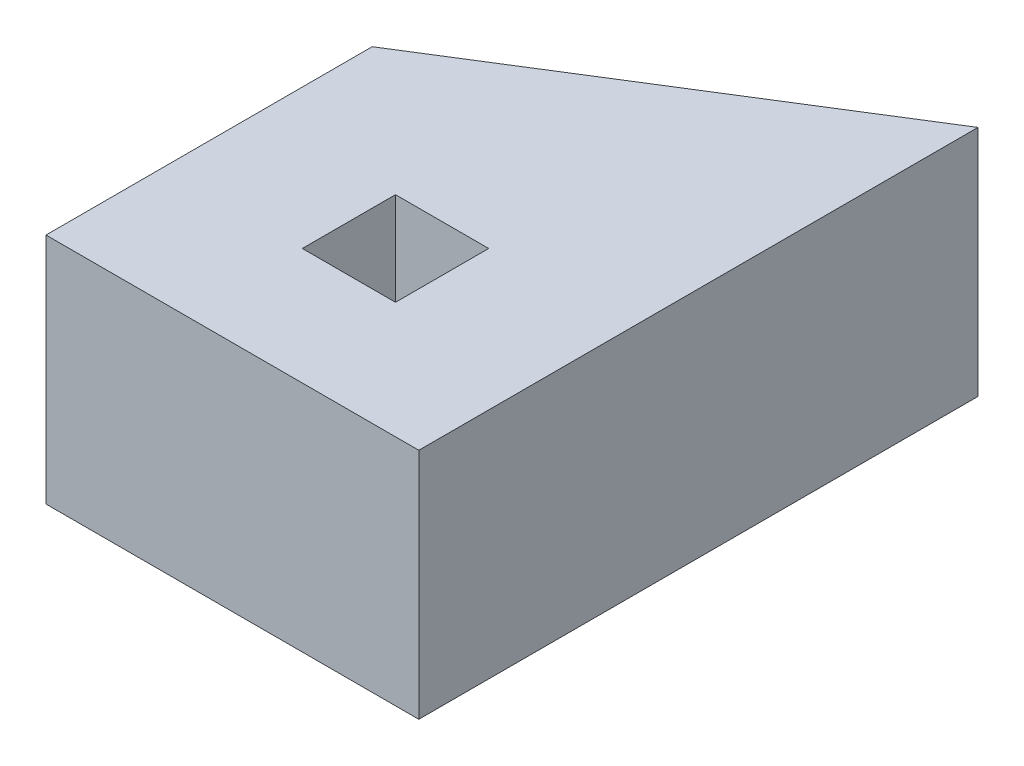
ISO-10303-21;
HEADER;
FILE_DESCRIPTION(('STEP AP214'),'2;1');
FILE_NAME('part.step','',(''),(''),'','','');
FILE_SCHEMA(('AUTOMOTIVE_DESIGN { 1 0 10303 214 1 1 1 1 }'));
ENDSEC;
DATA;
#1=APPLICATION_CONTEXT('core data for automotive mechanical design processes');
#2=APPLICATION_PROTOCOL_DEFINITION('international standard','automotive_design',2000,#1);
#3=PRODUCT_CONTEXT('',#1,'mechanical');
#4=PRODUCT('Part','Part','',(#3));
#5=PRODUCT_RELATED_PRODUCT_CATEGORY('part','',(#4));
#6=PRODUCT_DEFINITION_FORMATION('','',#4);
#7=PRODUCT_DEFINITION_CONTEXT('part definition',#1,'design');
#8=PRODUCT_DEFINITION('design','',#6,#7);
#9=PRODUCT_DEFINITION_SHAPE('','',#8);
#10=(LENGTH_UNIT() NAMED_UNIT(*) SI_UNIT(.MILLI.,.METRE.));
#11=(NAMED_UNIT(*) PLANE_ANGLE_UNIT() SI_UNIT($,.RADIAN.));
#12=(NAMED_UNIT(*) SI_UNIT($,.STERADIAN.) SOLID_ANGLE_UNIT());
#13=UNCERTAINTY_MEASURE_WITH_UNIT(LENGTH_MEASURE(1.E-05),#10,'distance_accuracy_value','');
#14=(GEOMETRIC_REPRESENTATION_CONTEXT(3) GLOBAL_UNCERTAINTY_ASSIGNED_CONTEXT((#13)) GLOBAL_UNIT_ASSIGNED_CONTEXT((#10,
#11,#12)) REPRESENTATION_CONTEXT('',''));
#15=CARTESIAN_POINT('',(0.,0.,0.));
#16=DIRECTION('',(0.,0.,1.));
#17=DIRECTION('',(1.,0.,0.));
#18=AXIS2_PLACEMENT_3D('',#15,#16,#17);
#19=CARTESIAN_POINT('',(0.,50.,35.));
#20=DIRECTION('',(0.,0.,-1.));
#21=DIRECTION('',(-1.,0.,0.));
#22=AXIS2_PLACEMENT_3D('',#19,#20,#21);
#23=PLANE('',#22);
#24=DIRECTION('',(1.,0.,0.));
#25=VECTOR('',#24,1.);
#26=CARTESIAN_POINT('',(0.,0.,35.));
#27=LINE('',#26,#25);
#28=CARTESIAN_POINT('',(-40.,0.,35.));
#29=VERTEX_POINT('',#28);
#30=CARTESIAN_POINT('',(40.,0.,35.));
#31=VERTEX_POINT('',#30);
#32=EDGE_CURVE('E131',#29,#31,#27,.T.);
#33=ORIENTED_EDGE('',*,*,#32,.T.);
#34=DIRECTION('',(0.,-1.,0.));
#35=VECTOR('',#34,1.);
#36=CARTESIAN_POINT('',(40.,50.,35.));
#37=LINE('',#36,#35);
#38=CARTESIAN_POINT('',(40.,50.,35.));
#39=VERTEX_POINT('',#38);
#40=EDGE_CURVE('E11',#39,#31,#37,.T.);
#41=ORIENTED_EDGE('',*,*,#40,.F.);
#42=DIRECTION('',(1.,0.,0.));
#43=VECTOR('',#42,1.);
#44=CARTESIAN_POINT('',(0.,50.,35.));
#45=LINE('',#44,#43);
#46=CARTESIAN_POINT('',(-40.,50.,35.));
#47=VERTEX_POINT('',#46);
#48=EDGE_CURVE('E135',#47,#39,#45,.T.);
#49=ORIENTED_EDGE('',*,*,#48,.F.);
#50=DIRECTION('',(0.,-1.,0.));
#51=VECTOR('',#50,1.);
#52=CARTESIAN_POINT('',(-40.,50.,35.));
#53=LINE('',#52,#51);
#54=EDGE_CURVE('E146',#47,#29,#53,.T.);
#55=ORIENTED_EDGE('',*,*,#54,.T.);
#56=EDGE_LOOP('',(#33,#41,#49,#55));
#57=FACE_BOUND('',#56,.T.);
#58=ADVANCED_FACE('F34',(#57),#23,.F.);
#59=CARTESIAN_POINT('',(40.,50.,0.));
#60=DIRECTION('',(-1.,0.,0.));
#61=DIRECTION('',(0.,0.,1.));
#62=AXIS2_PLACEMENT_3D('',#59,#60,#61);
#63=PLANE('',#62);
#64=DIRECTION('',(0.,0.,-1.));
#65=VECTOR('',#64,1.);
#66=CARTESIAN_POINT('',(40.,0.,0.));
#67=LINE('',#66,#65);
#68=CARTESIAN_POINT('',(40.,0.,-85.));
#69=VERTEX_POINT('',#68);
#70=EDGE_CURVE('E149',#31,#69,#67,.T.);
#71=ORIENTED_EDGE('',*,*,#70,.T.);
#72=DIRECTION('',(0.,-1.,0.));
#73=VECTOR('',#72,1.);
#74=CARTESIAN_POINT('',(40.,50.,-85.));
#75=LINE('',#74,#73);
#76=CARTESIAN_POINT('',(40.,50.,-85.));
#77=VERTEX_POINT('',#76);
#78=EDGE_CURVE('E41',#77,#69,#75,.T.);
#79=ORIENTED_EDGE('',*,*,#78,.F.);
#80=DIRECTION('',(0.,0.,-1.));
#81=VECTOR('',#80,1.);
#82=CARTESIAN_POINT('',(40.,50.,0.));
#83=LINE('',#82,#81);
#84=EDGE_CURVE('E138',#39,#77,#83,.T.);
#85=ORIENTED_EDGE('',*,*,#84,.F.);
#86=ORIENTED_EDGE('',*,*,#40,.T.);
#87=EDGE_LOOP('',(#71,#79,#85,#86));
#88=FACE_BOUND('',#87,.T.);
#89=ADVANCED_FACE('F175',(#88),#63,.F.);
#90=CARTESIAN_POINT('',(-26.9662921348315,50.,-43.1460674157303));
#91=DIRECTION('',(0.52999894000318,0.,0.847998304005088));
#92=DIRECTION('',(0.847998304005088,0.,-0.52999894000318));
#93=AXIS2_PLACEMENT_3D('',#90,#91,#92);
#94=PLANE('',#93);
#95=DIRECTION('',(-0.847998304005088,0.,0.52999894000318));
#96=VECTOR('',#95,1.);
#97=CARTESIAN_POINT('',(-26.9662921348315,0.,-43.1460674157303));
#98=LINE('',#97,#96);
#99=CARTESIAN_POINT('',(-40.,0.,-35.));
#100=VERTEX_POINT('',#99);
#101=EDGE_CURVE('E151',#69,#100,#98,.T.);
#102=ORIENTED_EDGE('',*,*,#101,.T.);
#103=DIRECTION('',(0.,-1.,0.));
#104=VECTOR('',#103,1.);
#105=CARTESIAN_POINT('',(-40.,50.,-35.));
#106=LINE('',#105,#104);
#107=CARTESIAN_POINT('',(-40.,50.,-35.));
#108=VERTEX_POINT('',#107);
#109=EDGE_CURVE('E157',#108,#100,#106,.T.);
#110=ORIENTED_EDGE('',*,*,#109,.F.);
#111=DIRECTION('',(-0.847998304005088,0.,0.52999894000318));
#112=VECTOR('',#111,1.);
#113=CARTESIAN_POINT('',(-26.9662921348315,50.,-43.1460674157303));
#114=LINE('',#113,#112);
#115=EDGE_CURVE('E141',#77,#108,#114,.T.);
#116=ORIENTED_EDGE('',*,*,#115,.F.);
#117=ORIENTED_EDGE('',*,*,#78,.T.);
#118=EDGE_LOOP('',(#102,#110,#116,#117));
#119=FACE_BOUND('',#118,.T.);
#120=ADVANCED_FACE('F163',(#119),#94,.F.);
#121=CARTESIAN_POINT('',(-40.,50.,0.));
#122=DIRECTION('',(-1.,0.,0.));
#123=DIRECTION('',(0.,0.,1.));
#124=AXIS2_PLACEMENT_3D('',#121,#122,#123);
#125=PLANE('',#124);
#126=DIRECTION('',(0.,0.,-1.));
#127=VECTOR('',#126,1.);
#128=CARTESIAN_POINT('',(-40.,0.,0.));
#129=LINE('',#128,#127);
#130=EDGE_CURVE('E139',#29,#100,#129,.T.);
#131=ORIENTED_EDGE('',*,*,#130,.F.);
#132=ORIENTED_EDGE('',*,*,#54,.F.);
#133=DIRECTION('',(0.,0.,-1.));
#134=VECTOR('',#133,1.);
#135=CARTESIAN_POINT('',(-40.,50.,0.));
#136=LINE('',#135,#134);
#137=EDGE_CURVE('E143',#47,#108,#136,.T.);
#138=ORIENTED_EDGE('',*,*,#137,.T.);
#139=ORIENTED_EDGE('',*,*,#109,.T.);
#140=EDGE_LOOP('',(#131,#132,#138,#139));
#141=FACE_BOUND('',#140,.T.);
#142=ADVANCED_FACE('F169',(#141),#125,.T.);
#143=CARTESIAN_POINT('',(0.,50.,0.));
#144=DIRECTION('',(0.,1.,0.));
#145=DIRECTION('',(0.,0.,1.));
#146=AXIS2_PLACEMENT_3D('',#143,#144,#145);
#147=PLANE('',#146);
#148=DIRECTION('',(0.,0.,-1.));
#149=VECTOR('',#148,1.);
#150=CARTESIAN_POINT('',(10.,50.,10.));
#151=LINE('',#150,#149);
#152=CARTESIAN_POINT('',(10.,50.,10.));
#153=VERTEX_POINT('',#152);
#154=CARTESIAN_POINT('',(10.,50.,-10.));
#155=VERTEX_POINT('',#154);
#156=EDGE_CURVE('E48',#153,#155,#151,.T.);
#157=ORIENTED_EDGE('',*,*,#156,.F.);
#158=DIRECTION('',(1.,0.,0.));
#159=VECTOR('',#158,1.);
#160=CARTESIAN_POINT('',(-10.,50.,10.));
#161=LINE('',#160,#159);
#162=CARTESIAN_POINT('',(-10.,50.,10.));
#163=VERTEX_POINT('',#162);
#164=EDGE_CURVE('E116',#163,#153,#161,.T.);
#165=ORIENTED_EDGE('',*,*,#164,.F.);
#166=DIRECTION('',(0.,0.,1.));
#167=VECTOR('',#166,1.);
#168=CARTESIAN_POINT('',(-10.,50.,10.));
#169=LINE('',#168,#167);
#170=CARTESIAN_POINT('',(-10.,50.,-10.));
#171=VERTEX_POINT('',#170);
#172=EDGE_CURVE('E119',#171,#163,#169,.T.);
#173=ORIENTED_EDGE('',*,*,#172,.F.);
#174=DIRECTION('',(-1.,0.,0.));
#175=VECTOR('',#174,1.);
#176=CARTESIAN_POINT('',(-10.,50.,-10.));
#177=LINE('',#176,#175);
#178=EDGE_CURVE('E125',#155,#171,#177,.T.);
#179=ORIENTED_EDGE('',*,*,#178,.F.);
#180=EDGE_LOOP('',(#157,#165,#173,#179));
#181=FACE_BOUND('',#180,.T.);
#182=ORIENTED_EDGE('',*,*,#48,.T.);
#183=ORIENTED_EDGE('',*,*,#84,.T.);
#184=ORIENTED_EDGE('',*,*,#115,.T.);
#185=ORIENTED_EDGE('',*,*,#137,.F.);
#186=EDGE_LOOP('',(#182,#183,#184,#185));
#187=FACE_BOUND('',#186,.T.);
#188=ADVANCED_FACE('F173',(#181,#187),#147,.T.);
#189=CARTESIAN_POINT('',(0.,0.,0.));
#190=DIRECTION('',(0.,1.,0.));
#191=DIRECTION('',(0.,0.,1.));
#192=AXIS2_PLACEMENT_3D('',#189,#190,#191);
#193=PLANE('',#192);
#194=DIRECTION('',(1.,0.,0.));
#195=VECTOR('',#194,1.);
#196=CARTESIAN_POINT('',(-10.,0.,10.));
#197=LINE('',#196,#195);
#198=CARTESIAN_POINT('',(-10.,0.,10.));
#199=VERTEX_POINT('',#198);
#200=CARTESIAN_POINT('',(10.,0.,10.));
#201=VERTEX_POINT('',#200);
#202=EDGE_CURVE('E106',#199,#201,#197,.T.);
#203=ORIENTED_EDGE('',*,*,#202,.T.);
#204=DIRECTION('',(0.,0.,-1.));
#205=VECTOR('',#204,1.);
#206=CARTESIAN_POINT('',(10.,0.,10.));
#207=LINE('',#206,#205);
#208=CARTESIAN_POINT('',(10.,0.,-10.));
#209=VERTEX_POINT('',#208);
#210=EDGE_CURVE('E100',#201,#209,#207,.T.);
#211=ORIENTED_EDGE('',*,*,#210,.T.);
#212=DIRECTION('',(-1.,0.,0.));
#213=VECTOR('',#212,1.);
#214=CARTESIAN_POINT('',(-10.,0.,-10.));
#215=LINE('',#214,#213);
#216=CARTESIAN_POINT('',(-10.,0.,-10.));
#217=VERTEX_POINT('',#216);
#218=EDGE_CURVE('E109',#209,#217,#215,.T.);
#219=ORIENTED_EDGE('',*,*,#218,.T.);
#220=DIRECTION('',(0.,0.,1.));
#221=VECTOR('',#220,1.);
#222=CARTESIAN_POINT('',(-10.,0.,10.));
#223=LINE('',#222,#221);
#224=EDGE_CURVE('E56',#217,#199,#223,.T.);
#225=ORIENTED_EDGE('',*,*,#224,.T.);
#226=EDGE_LOOP('',(#203,#211,#219,#225));
#227=FACE_BOUND('',#226,.T.);
#228=ORIENTED_EDGE('',*,*,#32,.F.);
#229=ORIENTED_EDGE('',*,*,#130,.T.);
#230=ORIENTED_EDGE('',*,*,#101,.F.);
#231=ORIENTED_EDGE('',*,*,#70,.F.);
#232=EDGE_LOOP('',(#228,#229,#230,#231));
#233=FACE_BOUND('',#232,.T.);
#234=ADVANCED_FACE('F113',(#227,#233),#193,.F.);
#235=CARTESIAN_POINT('',(10.,0.,10.));
#236=DIRECTION('',(1.,0.,0.));
#237=DIRECTION('',(0.,0.,-1.));
#238=AXIS2_PLACEMENT_3D('',#235,#236,#237);
#239=PLANE('',#238);
#240=ORIENTED_EDGE('',*,*,#156,.T.);
#241=DIRECTION('',(0.,1.,0.));
#242=VECTOR('',#241,1.);
#243=CARTESIAN_POINT('',(10.,0.,-10.));
#244=LINE('',#243,#242);
#245=EDGE_CURVE('E96',#209,#155,#244,.T.);
#246=ORIENTED_EDGE('',*,*,#245,.F.);
#247=ORIENTED_EDGE('',*,*,#210,.F.);
#248=DIRECTION('',(0.,1.,0.));
#249=VECTOR('',#248,1.);
#250=CARTESIAN_POINT('',(10.,0.,10.));
#251=LINE('',#250,#249);
#252=EDGE_CURVE('E129',#201,#153,#251,.T.);
#253=ORIENTED_EDGE('',*,*,#252,.T.);
#254=EDGE_LOOP('',(#240,#246,#247,#253));
#255=FACE_BOUND('',#254,.T.);
#256=ADVANCED_FACE('F98',(#255),#239,.F.);
#257=CARTESIAN_POINT('',(-10.,0.,10.));
#258=DIRECTION('',(0.,0.,1.));
#259=DIRECTION('',(1.,0.,0.));
#260=AXIS2_PLACEMENT_3D('',#257,#258,#259);
#261=PLANE('',#260);
#262=ORIENTED_EDGE('',*,*,#164,.T.);
#263=ORIENTED_EDGE('',*,*,#252,.F.);
#264=ORIENTED_EDGE('',*,*,#202,.F.);
#265=DIRECTION('',(0.,1.,0.));
#266=VECTOR('',#265,1.);
#267=CARTESIAN_POINT('',(-10.,0.,10.));
#268=LINE('',#267,#266);
#269=EDGE_CURVE('E132',#199,#163,#268,.T.);
#270=ORIENTED_EDGE('',*,*,#269,.T.);
#271=EDGE_LOOP('',(#262,#263,#264,#270));
#272=FACE_BOUND('',#271,.T.);
#273=ADVANCED_FACE('F195',(#272),#261,.F.);
#274=CARTESIAN_POINT('',(-10.,0.,10.));
#275=DIRECTION('',(-1.,0.,0.));
#276=DIRECTION('',(0.,0.,1.));
#277=AXIS2_PLACEMENT_3D('',#274,#275,#276);
#278=PLANE('',#277);
#279=ORIENTED_EDGE('',*,*,#172,.T.);
#280=ORIENTED_EDGE('',*,*,#269,.F.);
#281=ORIENTED_EDGE('',*,*,#224,.F.);
#282=DIRECTION('',(0.,1.,0.));
#283=VECTOR('',#282,1.);
#284=CARTESIAN_POINT('',(-10.,0.,-10.));
#285=LINE('',#284,#283);
#286=EDGE_CURVE('E105',#217,#171,#285,.T.);
#287=ORIENTED_EDGE('',*,*,#286,.T.);
#288=EDGE_LOOP('',(#279,#280,#281,#287));
#289=FACE_BOUND('',#288,.T.);
#290=ADVANCED_FACE('F198',(#289),#278,.F.);
#291=CARTESIAN_POINT('',(-10.,0.,-10.));
#292=DIRECTION('',(0.,0.,-1.));
#293=DIRECTION('',(-1.,0.,0.));
#294=AXIS2_PLACEMENT_3D('',#291,#292,#293);
#295=PLANE('',#294);
#296=ORIENTED_EDGE('',*,*,#178,.T.);
#297=ORIENTED_EDGE('',*,*,#286,.F.);
#298=ORIENTED_EDGE('',*,*,#218,.F.);
#299=ORIENTED_EDGE('',*,*,#245,.T.);
#300=EDGE_LOOP('',(#296,#297,#298,#299));
#301=FACE_BOUND('',#300,.T.);
#302=ADVANCED_FACE('F110',(#301),#295,.F.);
#303=CLOSED_SHELL('',(#58,#89,#120,#142,#188,#234,#256,#273,#290,#302));
#304=MANIFOLD_SOLID_BREP('B2',#303);
#305=ADVANCED_BREP_SHAPE_REPRESENTATION('',(#18,#304),#14);
#306=SHAPE_DEFINITION_REPRESENTATION(#9,#305);
ENDSEC;
END-ISO-10303-21;
